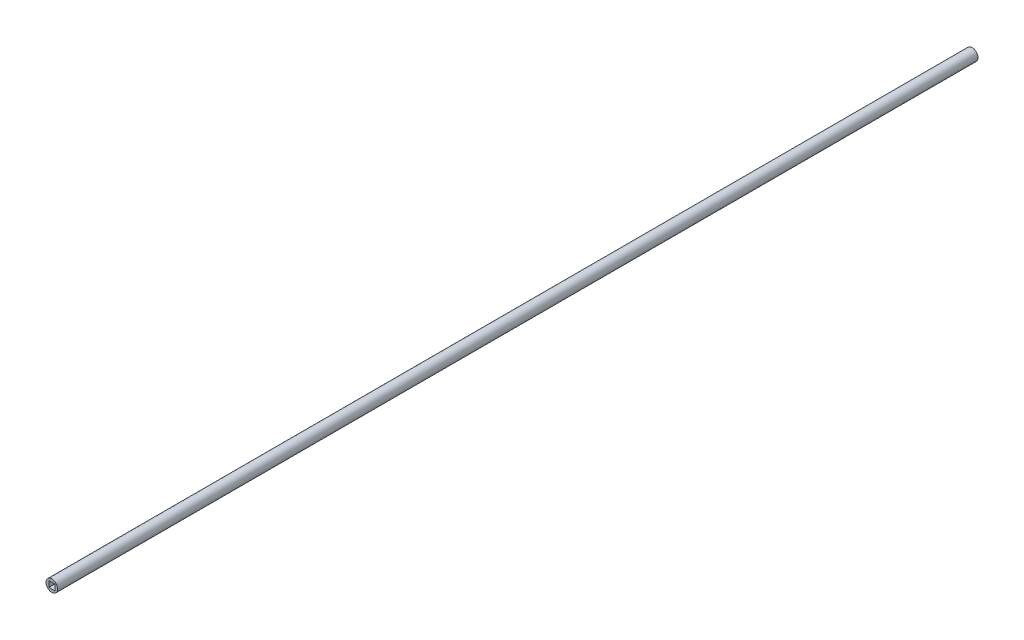
ISO-10303-21;
HEADER;
FILE_DESCRIPTION(('STEP AP214'),'2;1');
FILE_NAME('part.step','',(''),(''),'','','');
FILE_SCHEMA(('AUTOMOTIVE_DESIGN { 1 0 10303 214 1 1 1 1 }'));
ENDSEC;
DATA;
#1=APPLICATION_CONTEXT('core data for automotive mechanical design processes');
#2=APPLICATION_PROTOCOL_DEFINITION('international standard','automotive_design',2000,#1);
#3=PRODUCT_CONTEXT('',#1,'mechanical');
#4=PRODUCT('Part','Part','',(#3));
#5=PRODUCT_RELATED_PRODUCT_CATEGORY('part','',(#4));
#6=PRODUCT_DEFINITION_FORMATION('','',#4);
#7=PRODUCT_DEFINITION_CONTEXT('part definition',#1,'design');
#8=PRODUCT_DEFINITION('design','',#6,#7);
#9=PRODUCT_DEFINITION_SHAPE('','',#8);
#10=(LENGTH_UNIT() NAMED_UNIT(*) SI_UNIT(.MILLI.,.METRE.));
#11=(NAMED_UNIT(*) PLANE_ANGLE_UNIT() SI_UNIT($,.RADIAN.));
#12=(NAMED_UNIT(*) SI_UNIT($,.STERADIAN.) SOLID_ANGLE_UNIT());
#13=UNCERTAINTY_MEASURE_WITH_UNIT(LENGTH_MEASURE(1.E-05),#10,'distance_accuracy_value','');
#14=(GEOMETRIC_REPRESENTATION_CONTEXT(3) GLOBAL_UNCERTAINTY_ASSIGNED_CONTEXT((#13)) GLOBAL_UNIT_ASSIGNED_CONTEXT((#10,
#11,#12)) REPRESENTATION_CONTEXT('',''));
#15=CARTESIAN_POINT('',(0.,0.,0.));
#16=DIRECTION('',(0.,0.,1.));
#17=DIRECTION('',(1.,0.,0.));
#18=AXIS2_PLACEMENT_3D('',#15,#16,#17);
#19=CARTESIAN_POINT('',(0.,0.,-153.75));
#20=DIRECTION('',(0.,0.,1.));
#21=DIRECTION('',(-1.,0.,0.));
#22=AXIS2_PLACEMENT_3D('',#19,#20,#21);
#23=CYLINDRICAL_SURFACE('',#22,0.975);
#24=CARTESIAN_POINT('',(0.,0.,-153.75));
#25=DIRECTION('',(0.,0.,1.));
#26=DIRECTION('',(1.,0.,0.));
#27=AXIS2_PLACEMENT_3D('',#24,#25,#26);
#28=CIRCLE('',#27,0.975);
#29=CARTESIAN_POINT('',(0.975,0.,-153.75));
#30=VERTEX_POINT('',#29);
#31=EDGE_CURVE('E11',#30,#30,#28,.T.);
#32=ORIENTED_EDGE('',*,*,#31,.T.);
#33=EDGE_LOOP('',(#32));
#34=FACE_BOUND('',#33,.T.);
#35=CARTESIAN_POINT('',(0.,0.,0.));
#36=DIRECTION('',(0.,0.,1.));
#37=DIRECTION('',(1.,0.,0.));
#38=AXIS2_PLACEMENT_3D('',#35,#36,#37);
#39=CIRCLE('',#38,0.975);
#40=CARTESIAN_POINT('',(0.975,0.,0.));
#41=VERTEX_POINT('',#40);
#42=EDGE_CURVE('E50',#41,#41,#39,.T.);
#43=ORIENTED_EDGE('',*,*,#42,.F.);
#44=EDGE_LOOP('',(#43));
#45=FACE_BOUND('',#44,.T.);
#46=ADVANCED_FACE('F47',(#34,#45),#23,.T.);
#47=CARTESIAN_POINT('',(0.,0.,-153.75));
#48=DIRECTION('',(0.,0.,-1.));
#49=DIRECTION('',(1.,0.,0.));
#50=AXIS2_PLACEMENT_3D('',#47,#48,#49);
#51=PLANE('',#50);
#52=ORIENTED_EDGE('',*,*,#31,.F.);
#53=EDGE_LOOP('',(#52));
#54=FACE_BOUND('',#53,.T.);
#55=ADVANCED_FACE('F139',(#54),#51,.T.);
#56=CARTESIAN_POINT('',(0.,0.,0.));
#57=DIRECTION('',(0.,0.,-1.));
#58=DIRECTION('',(1.,0.,0.));
#59=AXIS2_PLACEMENT_3D('',#56,#57,#58);
#60=PLANE('',#59);
#61=DIRECTION('',(-1.,0.,0.));
#62=VECTOR('',#61,1.);
#63=CARTESIAN_POINT('',(0.5,-0.5,0.));
#64=LINE('',#63,#62);
#65=CARTESIAN_POINT('',(0.5,-0.5,0.));
#66=VERTEX_POINT('',#65);
#67=CARTESIAN_POINT('',(-0.5,-0.5,0.));
#68=VERTEX_POINT('',#67);
#69=EDGE_CURVE('E119',#66,#68,#64,.T.);
#70=ORIENTED_EDGE('',*,*,#69,.T.);
#71=DIRECTION('',(0.,1.,0.));
#72=VECTOR('',#71,1.);
#73=CARTESIAN_POINT('',(-0.5,0.5,0.));
#74=LINE('',#73,#72);
#75=CARTESIAN_POINT('',(-0.5,0.5,0.));
#76=VERTEX_POINT('',#75);
#77=EDGE_CURVE('E107',#68,#76,#74,.T.);
#78=ORIENTED_EDGE('',*,*,#77,.T.);
#79=DIRECTION('',(1.,0.,0.));
#80=VECTOR('',#79,1.);
#81=CARTESIAN_POINT('',(0.5,0.5,0.));
#82=LINE('',#81,#80);
#83=CARTESIAN_POINT('',(0.5,0.5,0.));
#84=VERTEX_POINT('',#83);
#85=EDGE_CURVE('E115',#76,#84,#82,.T.);
#86=ORIENTED_EDGE('',*,*,#85,.T.);
#87=DIRECTION('',(0.,-1.,0.));
#88=VECTOR('',#87,1.);
#89=CARTESIAN_POINT('',(0.5,0.5,0.));
#90=LINE('',#89,#88);
#91=EDGE_CURVE('E121',#84,#66,#90,.T.);
#92=ORIENTED_EDGE('',*,*,#91,.T.);
#93=EDGE_LOOP('',(#70,#78,#86,#92));
#94=FACE_BOUND('',#93,.T.);
#95=ORIENTED_EDGE('',*,*,#42,.T.);
#96=EDGE_LOOP('',(#95));
#97=FACE_BOUND('',#96,.T.);
#98=ADVANCED_FACE('F126',(#94,#97),#60,.F.);
#99=CARTESIAN_POINT('',(0.5,0.5,-5.));
#100=DIRECTION('',(1.,0.,0.));
#101=DIRECTION('',(0.,0.,1.));
#102=AXIS2_PLACEMENT_3D('',#99,#100,#101);
#103=PLANE('',#102);
#104=ORIENTED_EDGE('',*,*,#91,.F.);
#105=DIRECTION('',(0.,0.,1.));
#106=VECTOR('',#105,1.);
#107=CARTESIAN_POINT('',(0.5,0.5,-5.));
#108=LINE('',#107,#106);
#109=CARTESIAN_POINT('',(0.5,0.5,-5.));
#110=VERTEX_POINT('',#109);
#111=EDGE_CURVE('E86',#110,#84,#108,.T.);
#112=ORIENTED_EDGE('',*,*,#111,.F.);
#113=DIRECTION('',(0.,-1.,0.));
#114=VECTOR('',#113,1.);
#115=CARTESIAN_POINT('',(0.5,0.5,-5.));
#116=LINE('',#115,#114);
#117=CARTESIAN_POINT('',(0.5,-0.5,-5.));
#118=VERTEX_POINT('',#117);
#119=EDGE_CURVE('E100',#110,#118,#116,.T.);
#120=ORIENTED_EDGE('',*,*,#119,.T.);
#121=DIRECTION('',(0.,0.,1.));
#122=VECTOR('',#121,1.);
#123=CARTESIAN_POINT('',(0.5,-0.5,-5.));
#124=LINE('',#123,#122);
#125=EDGE_CURVE('E61',#118,#66,#124,.T.);
#126=ORIENTED_EDGE('',*,*,#125,.T.);
#127=EDGE_LOOP('',(#104,#112,#120,#126));
#128=FACE_BOUND('',#127,.T.);
#129=ADVANCED_FACE('F124',(#128),#103,.F.);
#130=CARTESIAN_POINT('',(0.5,0.5,-5.));
#131=DIRECTION('',(0.,1.,0.));
#132=DIRECTION('',(0.,0.,-1.));
#133=AXIS2_PLACEMENT_3D('',#130,#131,#132);
#134=PLANE('',#133);
#135=ORIENTED_EDGE('',*,*,#85,.F.);
#136=DIRECTION('',(0.,0.,1.));
#137=VECTOR('',#136,1.);
#138=CARTESIAN_POINT('',(-0.5,0.5,-5.));
#139=LINE('',#138,#137);
#140=CARTESIAN_POINT('',(-0.5,0.5,-5.));
#141=VERTEX_POINT('',#140);
#142=EDGE_CURVE('E109',#141,#76,#139,.T.);
#143=ORIENTED_EDGE('',*,*,#142,.F.);
#144=DIRECTION('',(1.,0.,0.));
#145=VECTOR('',#144,1.);
#146=CARTESIAN_POINT('',(0.5,0.5,-5.));
#147=LINE('',#146,#145);
#148=EDGE_CURVE('E70',#141,#110,#147,.T.);
#149=ORIENTED_EDGE('',*,*,#148,.T.);
#150=ORIENTED_EDGE('',*,*,#111,.T.);
#151=EDGE_LOOP('',(#135,#143,#149,#150));
#152=FACE_BOUND('',#151,.T.);
#153=ADVANCED_FACE('F128',(#152),#134,.F.);
#154=CARTESIAN_POINT('',(-0.5,0.5,-5.));
#155=DIRECTION('',(-1.,0.,0.));
#156=DIRECTION('',(0.,0.,-1.));
#157=AXIS2_PLACEMENT_3D('',#154,#155,#156);
#158=PLANE('',#157);
#159=ORIENTED_EDGE('',*,*,#77,.F.);
#160=DIRECTION('',(0.,0.,1.));
#161=VECTOR('',#160,1.);
#162=CARTESIAN_POINT('',(-0.5,-0.5,-5.));
#163=LINE('',#162,#161);
#164=CARTESIAN_POINT('',(-0.5,-0.5,-5.));
#165=VERTEX_POINT('',#164);
#166=EDGE_CURVE('E97',#165,#68,#163,.T.);
#167=ORIENTED_EDGE('',*,*,#166,.F.);
#168=DIRECTION('',(0.,1.,0.));
#169=VECTOR('',#168,1.);
#170=CARTESIAN_POINT('',(-0.5,0.5,-5.));
#171=LINE('',#170,#169);
#172=EDGE_CURVE('E99',#165,#141,#171,.T.);
#173=ORIENTED_EDGE('',*,*,#172,.T.);
#174=ORIENTED_EDGE('',*,*,#142,.T.);
#175=EDGE_LOOP('',(#159,#167,#173,#174));
#176=FACE_BOUND('',#175,.T.);
#177=ADVANCED_FACE('F105',(#176),#158,.F.);
#178=CARTESIAN_POINT('',(0.5,-0.5,-5.));
#179=DIRECTION('',(0.,-1.,0.));
#180=DIRECTION('',(0.,0.,1.));
#181=AXIS2_PLACEMENT_3D('',#178,#179,#180);
#182=PLANE('',#181);
#183=ORIENTED_EDGE('',*,*,#69,.F.);
#184=ORIENTED_EDGE('',*,*,#125,.F.);
#185=DIRECTION('',(-1.,0.,0.));
#186=VECTOR('',#185,1.);
#187=CARTESIAN_POINT('',(0.5,-0.5,-5.));
#188=LINE('',#187,#186);
#189=EDGE_CURVE('E92',#118,#165,#188,.T.);
#190=ORIENTED_EDGE('',*,*,#189,.T.);
#191=ORIENTED_EDGE('',*,*,#166,.T.);
#192=EDGE_LOOP('',(#183,#184,#190,#191));
#193=FACE_BOUND('',#192,.T.);
#194=ADVANCED_FACE('F95',(#193),#182,.F.);
#195=CARTESIAN_POINT('',(0.,0.,-5.));
#196=DIRECTION('',(0.,0.,1.));
#197=DIRECTION('',(-1.,0.,0.));
#198=AXIS2_PLACEMENT_3D('',#195,#196,#197);
#199=PLANE('',#198);
#200=ORIENTED_EDGE('',*,*,#119,.F.);
#201=ORIENTED_EDGE('',*,*,#148,.F.);
#202=ORIENTED_EDGE('',*,*,#172,.F.);
#203=ORIENTED_EDGE('',*,*,#189,.F.);
#204=EDGE_LOOP('',(#200,#201,#202,#203));
#205=FACE_BOUND('',#204,.T.);
#206=ADVANCED_FACE('F102',(#205),#199,.T.);
#207=CLOSED_SHELL('',(#46,#55,#98,#129,#153,#177,#194,#206));
#208=MANIFOLD_SOLID_BREP('B2',#207);
#209=ADVANCED_BREP_SHAPE_REPRESENTATION('',(#18,#208),#14);
#210=SHAPE_DEFINITION_REPRESENTATION(#9,#209);
ENDSEC;
END-ISO-10303-21;
